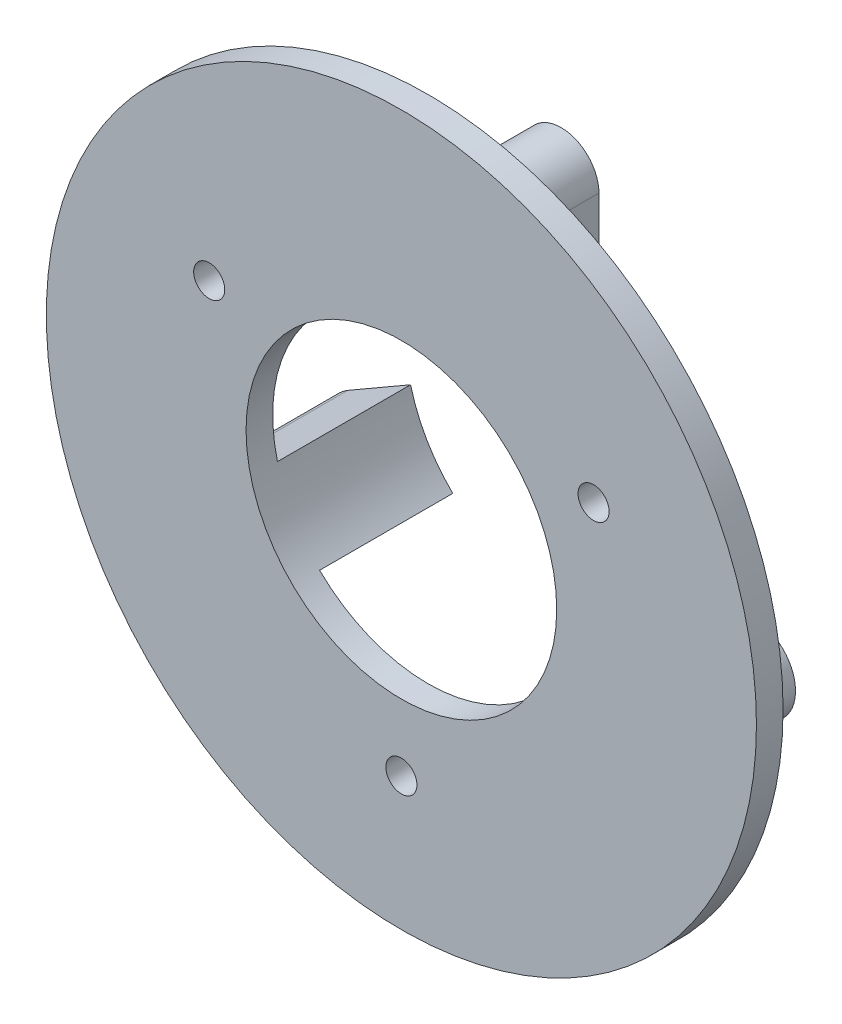
ISO-10303-21;
HEADER;
FILE_DESCRIPTION(('STEP AP214'),'2;1');
FILE_NAME('part.step','',(''),(''),'','','');
FILE_SCHEMA(('AUTOMOTIVE_DESIGN { 1 0 10303 214 1 1 1 1 }'));
ENDSEC;
DATA;
#1=APPLICATION_CONTEXT('core data for automotive mechanical design processes');
#2=APPLICATION_PROTOCOL_DEFINITION('international standard','automotive_design',2000,#1);
#3=PRODUCT_CONTEXT('',#1,'mechanical');
#4=PRODUCT('Part','Part','',(#3));
#5=PRODUCT_RELATED_PRODUCT_CATEGORY('part','',(#4));
#6=PRODUCT_DEFINITION_FORMATION('','',#4);
#7=PRODUCT_DEFINITION_CONTEXT('part definition',#1,'design');
#8=PRODUCT_DEFINITION('design','',#6,#7);
#9=PRODUCT_DEFINITION_SHAPE('','',#8);
#10=(LENGTH_UNIT() NAMED_UNIT(*) SI_UNIT(.MILLI.,.METRE.));
#11=(NAMED_UNIT(*) PLANE_ANGLE_UNIT() SI_UNIT($,.RADIAN.));
#12=(NAMED_UNIT(*) SI_UNIT($,.STERADIAN.) SOLID_ANGLE_UNIT());
#13=UNCERTAINTY_MEASURE_WITH_UNIT(LENGTH_MEASURE(1.E-05),#10,'distance_accuracy_value','');
#14=(GEOMETRIC_REPRESENTATION_CONTEXT(3) GLOBAL_UNCERTAINTY_ASSIGNED_CONTEXT((#13)) GLOBAL_UNIT_ASSIGNED_CONTEXT((#10,
#11,#12)) REPRESENTATION_CONTEXT('',''));
#15=CARTESIAN_POINT('',(0.,0.,0.));
#16=DIRECTION('',(0.,0.,1.));
#17=DIRECTION('',(1.,0.,0.));
#18=AXIS2_PLACEMENT_3D('',#15,#16,#17);
#19=CARTESIAN_POINT('',(0.,0.,1.2));
#20=DIRECTION('',(0.,0.,-1.));
#21=DIRECTION('',(-1.,0.,0.));
#22=AXIS2_PLACEMENT_3D('',#19,#20,#21);
#23=CYLINDRICAL_SURFACE('',#22,16.);
#24=CARTESIAN_POINT('',(0.,0.,1.2));
#25=DIRECTION('',(0.,0.,1.));
#26=DIRECTION('',(1.,0.,0.));
#27=AXIS2_PLACEMENT_3D('',#24,#25,#26);
#28=CIRCLE('',#27,16.);
#29=CARTESIAN_POINT('',(16.,0.,1.2));
#30=VERTEX_POINT('',#29);
#31=EDGE_CURVE('E238',#30,#30,#28,.T.);
#32=ORIENTED_EDGE('',*,*,#31,.F.);
#33=EDGE_LOOP('',(#32));
#34=FACE_BOUND('',#33,.T.);
#35=CARTESIAN_POINT('',(0.,0.,0.));
#36=DIRECTION('',(0.,0.,1.));
#37=DIRECTION('',(1.,0.,0.));
#38=AXIS2_PLACEMENT_3D('',#35,#36,#37);
#39=CIRCLE('',#38,16.);
#40=CARTESIAN_POINT('',(16.,0.,0.));
#41=VERTEX_POINT('',#40);
#42=EDGE_CURVE('E286',#41,#41,#39,.T.);
#43=ORIENTED_EDGE('',*,*,#42,.T.);
#44=EDGE_LOOP('',(#43));
#45=FACE_BOUND('',#44,.T.);
#46=ADVANCED_FACE('F39',(#34,#45),#23,.T.);
#47=CARTESIAN_POINT('',(0.,0.,1.2));
#48=DIRECTION('',(0.,0.,1.));
#49=DIRECTION('',(1.,0.,0.));
#50=AXIS2_PLACEMENT_3D('',#47,#48,#49);
#51=PLANE('',#50);
#52=CARTESIAN_POINT('',(8.66025403784438,5.00000000000001,1.2));
#53=DIRECTION('',(0.,0.,1.));
#54=DIRECTION('',(1.,0.,0.));
#55=AXIS2_PLACEMENT_3D('',#52,#53,#54);
#56=CIRCLE('',#55,0.7);
#57=CARTESIAN_POINT('',(9.36025403784438,5.00000000000001,1.2));
#58=VERTEX_POINT('',#57);
#59=EDGE_CURVE('E258',#58,#58,#56,.T.);
#60=ORIENTED_EDGE('',*,*,#59,.F.);
#61=EDGE_LOOP('',(#60));
#62=FACE_BOUND('',#61,.T.);
#63=CARTESIAN_POINT('',(0.,-10.,1.2));
#64=DIRECTION('',(0.,0.,1.));
#65=DIRECTION('',(1.,0.,0.));
#66=AXIS2_PLACEMENT_3D('',#63,#64,#65);
#67=CIRCLE('',#66,0.7);
#68=CARTESIAN_POINT('',(0.7,-10.,1.2));
#69=VERTEX_POINT('',#68);
#70=EDGE_CURVE('E266',#69,#69,#67,.T.);
#71=ORIENTED_EDGE('',*,*,#70,.F.);
#72=EDGE_LOOP('',(#71));
#73=FACE_BOUND('',#72,.T.);
#74=CARTESIAN_POINT('',(-8.66025403784438,5.00000000000001,1.2));
#75=DIRECTION('',(0.,0.,1.));
#76=DIRECTION('',(1.,0.,0.));
#77=AXIS2_PLACEMENT_3D('',#74,#75,#76);
#78=CIRCLE('',#77,0.7);
#79=CARTESIAN_POINT('',(-7.96025403784438,5.00000000000001,1.2));
#80=VERTEX_POINT('',#79);
#81=EDGE_CURVE('E252',#80,#80,#78,.T.);
#82=ORIENTED_EDGE('',*,*,#81,.F.);
#83=EDGE_LOOP('',(#82));
#84=FACE_BOUND('',#83,.T.);
#85=CARTESIAN_POINT('',(0.,0.,1.2));
#86=DIRECTION('',(0.,0.,1.));
#87=DIRECTION('',(1.,0.,0.));
#88=AXIS2_PLACEMENT_3D('',#85,#86,#87);
#89=CIRCLE('',#88,7.);
#90=CARTESIAN_POINT('',(7.,0.,1.2));
#91=VERTEX_POINT('',#90);
#92=EDGE_CURVE('E257',#91,#91,#89,.T.);
#93=ORIENTED_EDGE('',*,*,#92,.F.);
#94=EDGE_LOOP('',(#93));
#95=FACE_BOUND('',#94,.T.);
#96=ORIENTED_EDGE('',*,*,#31,.T.);
#97=EDGE_LOOP('',(#96));
#98=FACE_BOUND('',#97,.T.);
#99=ADVANCED_FACE('F349',(#62,#73,#84,#95,#98),#51,.T.);
#100=CARTESIAN_POINT('',(0.,0.,0.));
#101=DIRECTION('',(0.,0.,1.));
#102=DIRECTION('',(1.,0.,0.));
#103=AXIS2_PLACEMENT_3D('',#100,#101,#102);
#104=PLANE('',#103);
#105=DIRECTION('',(0.866025403784439,0.5,0.));
#106=VECTOR('',#105,1.);
#107=CARTESIAN_POINT('',(-5.53794600333848,-1.00340359286449,0.));
#108=LINE('',#107,#106);
#109=CARTESIAN_POINT('',(-9.61025403784438,-3.35455173280958,0.));
#110=VERTEX_POINT('',#109);
#111=CARTESIAN_POINT('',(-6.78459510163302,-1.72315678534985,0.));
#112=VERTEX_POINT('',#111);
#113=EDGE_CURVE('E62',#110,#112,#108,.T.);
#114=ORIENTED_EDGE('',*,*,#113,.F.);
#115=CARTESIAN_POINT('',(-8.66025403784438,-5.00000000000001,0.));
#116=DIRECTION('',(0.,0.,-1.));
#117=DIRECTION('',(-1.,0.,0.));
#118=AXIS2_PLACEMENT_3D('',#115,#116,#117);
#119=CIRCLE('',#118,1.9);
#120=CARTESIAN_POINT('',(-7.71025403784439,-6.64544826719042,0.));
#121=VERTEX_POINT('',#120);
#122=EDGE_CURVE('E163',#121,#110,#119,.T.);
#123=ORIENTED_EDGE('',*,*,#122,.F.);
#124=DIRECTION('',(-0.866025403784439,-0.5,0.));
#125=VECTOR('',#124,1.);
#126=CARTESIAN_POINT('',(-3.63794600333848,-4.29430012724536,0.));
#127=LINE('',#126,#125);
#128=CARTESIAN_POINT('',(-4.88459510163303,-5.01405331973072,0.));
#129=VERTEX_POINT('',#128);
#130=EDGE_CURVE('E170',#129,#121,#127,.T.);
#131=ORIENTED_EDGE('',*,*,#130,.F.);
#132=CARTESIAN_POINT('',(0.,0.,0.));
#133=DIRECTION('',(0.,0.,1.));
#134=DIRECTION('',(1.,0.,0.));
#135=AXIS2_PLACEMENT_3D('',#132,#133,#134);
#136=CIRCLE('',#135,7.);
#137=CARTESIAN_POINT('',(4.88459510163303,-5.01405331973072,0.));
#138=VERTEX_POINT('',#137);
#139=EDGE_CURVE('E133',#129,#138,#136,.T.);
#140=ORIENTED_EDGE('',*,*,#139,.T.);
#141=DIRECTION('',(-0.866025403784439,0.5,0.));
#142=VECTOR('',#141,1.);
#143=CARTESIAN_POINT('',(3.63794600333848,-4.29430012724536,0.));
#144=LINE('',#143,#142);
#145=CARTESIAN_POINT('',(7.71025403784439,-6.64544826719042,0.));
#146=VERTEX_POINT('',#145);
#147=EDGE_CURVE('E227',#146,#138,#144,.T.);
#148=ORIENTED_EDGE('',*,*,#147,.F.);
#149=CARTESIAN_POINT('',(8.66025403784438,-5.00000000000001,0.));
#150=DIRECTION('',(0.,0.,-1.));
#151=DIRECTION('',(-1.,0.,0.));
#152=AXIS2_PLACEMENT_3D('',#149,#150,#151);
#153=CIRCLE('',#152,1.9);
#154=CARTESIAN_POINT('',(9.61025403784438,-3.35455173280958,0.));
#155=VERTEX_POINT('',#154);
#156=EDGE_CURVE('E219',#155,#146,#153,.T.);
#157=ORIENTED_EDGE('',*,*,#156,.F.);
#158=DIRECTION('',(0.866025403784439,-0.5,0.));
#159=VECTOR('',#158,1.);
#160=CARTESIAN_POINT('',(5.53794600333848,-1.00340359286449,0.));
#161=LINE('',#160,#159);
#162=CARTESIAN_POINT('',(6.78459510163302,-1.72315678534985,0.));
#163=VERTEX_POINT('',#162);
#164=EDGE_CURVE('E47',#163,#155,#161,.T.);
#165=ORIENTED_EDGE('',*,*,#164,.F.);
#166=CARTESIAN_POINT('',(1.70389462333255,6.78945823409927,0.));
#167=VERTEX_POINT('',#166);
#168=EDGE_CURVE('E280',#163,#167,#136,.T.);
#169=ORIENTED_EDGE('',*,*,#168,.T.);
#170=DIRECTION('',(0.,-1.,0.));
#171=VECTOR('',#170,1.);
#172=CARTESIAN_POINT('',(1.70389462333255,5.39519544164019,0.));
#173=LINE('',#172,#171);
#174=CARTESIAN_POINT('',(1.70389462333255,10.,0.));
#175=VERTEX_POINT('',#174);
#176=EDGE_CURVE('E200',#175,#167,#173,.T.);
#177=ORIENTED_EDGE('',*,*,#176,.F.);
#178=CARTESIAN_POINT('',(0.,10.,0.));
#179=DIRECTION('',(0.,0.,-1.));
#180=DIRECTION('',(-1.,0.,0.));
#181=AXIS2_PLACEMENT_3D('',#178,#179,#180);
#182=CIRCLE('',#181,1.70389462333255);
#183=CARTESIAN_POINT('',(-1.70389462333255,10.,0.));
#184=VERTEX_POINT('',#183);
#185=EDGE_CURVE('E180',#184,#175,#182,.T.);
#186=ORIENTED_EDGE('',*,*,#185,.F.);
#187=DIRECTION('',(0.,1.,0.));
#188=VECTOR('',#187,1.);
#189=CARTESIAN_POINT('',(-1.70389462333255,10.,0.));
#190=LINE('',#189,#188);
#191=CARTESIAN_POINT('',(-1.70389462333255,6.78945823409927,0.));
#192=VERTEX_POINT('',#191);
#193=EDGE_CURVE('E189',#192,#184,#190,.T.);
#194=ORIENTED_EDGE('',*,*,#193,.F.);
#195=EDGE_CURVE('E279',#192,#112,#136,.T.);
#196=ORIENTED_EDGE('',*,*,#195,.T.);
#197=EDGE_LOOP('',(#114,#123,#131,#140,#148,#157,#165,#169,#177,#186,#194,#196));
#198=FACE_BOUND('',#197,.T.);
#199=CARTESIAN_POINT('',(8.66025403784438,5.00000000000001,0.));
#200=DIRECTION('',(0.,0.,1.));
#201=DIRECTION('',(1.,0.,0.));
#202=AXIS2_PLACEMENT_3D('',#199,#200,#201);
#203=CIRCLE('',#202,0.7);
#204=CARTESIAN_POINT('',(9.36025403784438,5.00000000000001,0.));
#205=VERTEX_POINT('',#204);
#206=EDGE_CURVE('E253',#205,#205,#203,.T.);
#207=ORIENTED_EDGE('',*,*,#206,.T.);
#208=EDGE_LOOP('',(#207));
#209=FACE_BOUND('',#208,.T.);
#210=CARTESIAN_POINT('',(0.,-10.,0.));
#211=DIRECTION('',(0.,0.,1.));
#212=DIRECTION('',(1.,0.,0.));
#213=AXIS2_PLACEMENT_3D('',#210,#211,#212);
#214=CIRCLE('',#213,0.7);
#215=CARTESIAN_POINT('',(0.7,-10.,0.));
#216=VERTEX_POINT('',#215);
#217=EDGE_CURVE('E262',#216,#216,#214,.T.);
#218=ORIENTED_EDGE('',*,*,#217,.T.);
#219=EDGE_LOOP('',(#218));
#220=FACE_BOUND('',#219,.T.);
#221=CARTESIAN_POINT('',(-8.66025403784438,5.00000000000001,0.));
#222=DIRECTION('',(0.,0.,1.));
#223=DIRECTION('',(1.,0.,0.));
#224=AXIS2_PLACEMENT_3D('',#221,#222,#223);
#225=CIRCLE('',#224,0.7);
#226=CARTESIAN_POINT('',(-7.96025403784438,5.00000000000001,0.));
#227=VERTEX_POINT('',#226);
#228=EDGE_CURVE('E270',#227,#227,#225,.T.);
#229=ORIENTED_EDGE('',*,*,#228,.T.);
#230=EDGE_LOOP('',(#229));
#231=FACE_BOUND('',#230,.T.);
#232=ORIENTED_EDGE('',*,*,#42,.F.);
#233=EDGE_LOOP('',(#232));
#234=FACE_BOUND('',#233,.T.);
#235=ADVANCED_FACE('F297',(#198,#209,#220,#231,#234),#104,.F.);
#236=CARTESIAN_POINT('',(0.,0.,0.));
#237=DIRECTION('',(0.,0.,1.));
#238=DIRECTION('',(1.,0.,0.));
#239=AXIS2_PLACEMENT_3D('',#236,#237,#238);
#240=CYLINDRICAL_SURFACE('',#239,7.);
#241=ORIENTED_EDGE('',*,*,#168,.F.);
#242=DIRECTION('',(0.,0.,1.));
#243=VECTOR('',#242,1.);
#244=CARTESIAN_POINT('',(6.78459510163302,-1.72315678534985,-9.8));
#245=LINE('',#244,#243);
#246=CARTESIAN_POINT('',(6.78459510163302,-1.72315678534985,-6.));
#247=VERTEX_POINT('',#246);
#248=EDGE_CURVE('E316',#247,#163,#245,.T.);
#249=ORIENTED_EDGE('',*,*,#248,.F.);
#250=CARTESIAN_POINT('',(0.,0.,-6.));
#251=DIRECTION('',(0.,0.,-1.));
#252=DIRECTION('',(-1.,0.,0.));
#253=AXIS2_PLACEMENT_3D('',#250,#251,#252);
#254=CIRCLE('',#253,7.);
#255=CARTESIAN_POINT('',(4.88459510163303,-5.01405331973072,-6.));
#256=VERTEX_POINT('',#255);
#257=EDGE_CURVE('E54',#247,#256,#254,.T.);
#258=ORIENTED_EDGE('',*,*,#257,.T.);
#259=DIRECTION('',(0.,0.,1.));
#260=VECTOR('',#259,1.);
#261=CARTESIAN_POINT('',(4.88459510163303,-5.01405331973072,-9.8));
#262=LINE('',#261,#260);
#263=EDGE_CURVE('E307',#138,#256,#262,.F.);
#264=ORIENTED_EDGE('',*,*,#263,.F.);
#265=ORIENTED_EDGE('',*,*,#139,.F.);
#266=DIRECTION('',(0.,0.,1.));
#267=VECTOR('',#266,1.);
#268=CARTESIAN_POINT('',(-4.88459510163303,-5.01405331973072,-9.8));
#269=LINE('',#268,#267);
#270=CARTESIAN_POINT('',(-4.88459510163303,-5.01405331973072,-6.));
#271=VERTEX_POINT('',#270);
#272=EDGE_CURVE('E11',#271,#129,#269,.T.);
#273=ORIENTED_EDGE('',*,*,#272,.F.);
#274=CARTESIAN_POINT('',(0.,0.,-6.));
#275=DIRECTION('',(0.,0.,-1.));
#276=DIRECTION('',(-1.,0.,0.));
#277=AXIS2_PLACEMENT_3D('',#274,#275,#276);
#278=CIRCLE('',#277,7.);
#279=CARTESIAN_POINT('',(-6.78459510163302,-1.72315678534985,-6.));
#280=VERTEX_POINT('',#279);
#281=EDGE_CURVE('E130',#271,#280,#278,.T.);
#282=ORIENTED_EDGE('',*,*,#281,.T.);
#283=DIRECTION('',(0.,0.,1.));
#284=VECTOR('',#283,1.);
#285=CARTESIAN_POINT('',(-6.78459510163302,-1.72315678534985,-9.8));
#286=LINE('',#285,#284);
#287=EDGE_CURVE('E147',#112,#280,#286,.F.);
#288=ORIENTED_EDGE('',*,*,#287,.F.);
#289=ORIENTED_EDGE('',*,*,#195,.F.);
#290=DIRECTION('',(0.,0.,1.));
#291=VECTOR('',#290,1.);
#292=CARTESIAN_POINT('',(-1.70389462333255,6.78945823409927,-9.8));
#293=LINE('',#292,#291);
#294=CARTESIAN_POINT('',(-1.70389462333255,6.78945823409927,-6.));
#295=VERTEX_POINT('',#294);
#296=EDGE_CURVE('E579',#295,#192,#293,.T.);
#297=ORIENTED_EDGE('',*,*,#296,.F.);
#298=CARTESIAN_POINT('',(0.,0.,-6.));
#299=DIRECTION('',(0.,0.,-1.));
#300=DIRECTION('',(-1.,0.,0.));
#301=AXIS2_PLACEMENT_3D('',#298,#299,#300);
#302=CIRCLE('',#301,7.);
#303=CARTESIAN_POINT('',(1.70389462333255,6.78945823409927,-6.));
#304=VERTEX_POINT('',#303);
#305=EDGE_CURVE('E573',#295,#304,#302,.T.);
#306=ORIENTED_EDGE('',*,*,#305,.T.);
#307=DIRECTION('',(0.,0.,1.));
#308=VECTOR('',#307,1.);
#309=CARTESIAN_POINT('',(1.70389462333255,6.78945823409927,-9.8));
#310=LINE('',#309,#308);
#311=EDGE_CURVE('E578',#167,#304,#310,.F.);
#312=ORIENTED_EDGE('',*,*,#311,.F.);
#313=EDGE_LOOP('',(#241,#249,#258,#264,#265,#273,#282,#288,#289,#297,#306,#312));
#314=FACE_BOUND('',#313,.T.);
#315=ORIENTED_EDGE('',*,*,#92,.T.);
#316=EDGE_LOOP('',(#315));
#317=FACE_BOUND('',#316,.T.);
#318=ADVANCED_FACE('F128',(#314,#317),#240,.F.);
#319=CARTESIAN_POINT('',(-8.66025403784438,5.00000000000001,0.));
#320=DIRECTION('',(0.,0.,1.));
#321=DIRECTION('',(1.,0.,0.));
#322=AXIS2_PLACEMENT_3D('',#319,#320,#321);
#323=CYLINDRICAL_SURFACE('',#322,0.7);
#324=ORIENTED_EDGE('',*,*,#228,.F.);
#325=EDGE_LOOP('',(#324));
#326=FACE_BOUND('',#325,.T.);
#327=ORIENTED_EDGE('',*,*,#81,.T.);
#328=EDGE_LOOP('',(#327));
#329=FACE_BOUND('',#328,.T.);
#330=ADVANCED_FACE('F366',(#326,#329),#323,.F.);
#331=CARTESIAN_POINT('',(0.,-10.,0.));
#332=DIRECTION('',(0.,0.,1.));
#333=DIRECTION('',(1.,0.,0.));
#334=AXIS2_PLACEMENT_3D('',#331,#332,#333);
#335=CYLINDRICAL_SURFACE('',#334,0.7);
#336=ORIENTED_EDGE('',*,*,#217,.F.);
#337=EDGE_LOOP('',(#336));
#338=FACE_BOUND('',#337,.T.);
#339=ORIENTED_EDGE('',*,*,#70,.T.);
#340=EDGE_LOOP('',(#339));
#341=FACE_BOUND('',#340,.T.);
#342=ADVANCED_FACE('F369',(#338,#341),#335,.F.);
#343=CARTESIAN_POINT('',(8.66025403784438,5.00000000000001,0.));
#344=DIRECTION('',(0.,0.,1.));
#345=DIRECTION('',(1.,0.,0.));
#346=AXIS2_PLACEMENT_3D('',#343,#344,#345);
#347=CYLINDRICAL_SURFACE('',#346,0.7);
#348=ORIENTED_EDGE('',*,*,#206,.F.);
#349=EDGE_LOOP('',(#348));
#350=FACE_BOUND('',#349,.T.);
#351=ORIENTED_EDGE('',*,*,#59,.T.);
#352=EDGE_LOOP('',(#351));
#353=FACE_BOUND('',#352,.T.);
#354=ADVANCED_FACE('F373',(#350,#353),#347,.F.);
#355=CARTESIAN_POINT('',(8.66025403784438,-5.00000000000001,-6.));
#356=DIRECTION('',(0.,0.,-1.));
#357=DIRECTION('',(-1.,0.,0.));
#358=AXIS2_PLACEMENT_3D('',#355,#356,#357);
#359=PLANE('',#358);
#360=ORIENTED_EDGE('',*,*,#257,.F.);
#361=DIRECTION('',(0.866025403784439,-0.5,0.));
#362=VECTOR('',#361,1.);
#363=CARTESIAN_POINT('',(5.53794600333848,-1.00340359286449,-6.));
#364=LINE('',#363,#362);
#365=CARTESIAN_POINT('',(9.61025403784438,-3.35455173280958,-6.));
#366=VERTEX_POINT('',#365);
#367=EDGE_CURVE('E223',#247,#366,#364,.T.);
#368=ORIENTED_EDGE('',*,*,#367,.T.);
#369=CARTESIAN_POINT('',(8.66025403784438,-5.00000000000001,-6.));
#370=DIRECTION('',(0.,0.,-1.));
#371=DIRECTION('',(-1.,0.,0.));
#372=AXIS2_PLACEMENT_3D('',#369,#370,#371);
#373=CIRCLE('',#372,1.9);
#374=CARTESIAN_POINT('',(7.71025403784439,-6.64544826719042,-6.));
#375=VERTEX_POINT('',#374);
#376=EDGE_CURVE('E226',#366,#375,#373,.T.);
#377=ORIENTED_EDGE('',*,*,#376,.T.);
#378=DIRECTION('',(-0.866025403784439,0.5,0.));
#379=VECTOR('',#378,1.);
#380=CARTESIAN_POINT('',(3.63794600333848,-4.29430012724536,-6.));
#381=LINE('',#380,#379);
#382=EDGE_CURVE('E230',#375,#256,#381,.T.);
#383=ORIENTED_EDGE('',*,*,#382,.T.);
#384=EDGE_LOOP('',(#360,#368,#377,#383));
#385=FACE_BOUND('',#384,.T.);
#386=CARTESIAN_POINT('',(8.66025403784438,-5.00000000000001,-6.));
#387=DIRECTION('',(0.,0.,-1.));
#388=DIRECTION('',(-1.,0.,0.));
#389=AXIS2_PLACEMENT_3D('',#386,#387,#388);
#390=CIRCLE('',#389,0.899999999999999);
#391=CARTESIAN_POINT('',(7.76025403784438,-5.00000000000001,-6.));
#392=VERTEX_POINT('',#391);
#393=EDGE_CURVE('E215',#392,#392,#390,.T.);
#394=ORIENTED_EDGE('',*,*,#393,.F.);
#395=EDGE_LOOP('',(#394));
#396=FACE_BOUND('',#395,.T.);
#397=ADVANCED_FACE('F377',(#385,#396),#359,.T.);
#398=CARTESIAN_POINT('',(5.53794600333848,-1.00340359286449,-6.));
#399=DIRECTION('',(-0.5,-0.866025403784439,0.));
#400=DIRECTION('',(0.866025403784439,-0.5,0.));
#401=AXIS2_PLACEMENT_3D('',#398,#399,#400);
#402=PLANE('',#401);
#403=ORIENTED_EDGE('',*,*,#367,.F.);
#404=ORIENTED_EDGE('',*,*,#248,.T.);
#405=ORIENTED_EDGE('',*,*,#164,.T.);
#406=DIRECTION('',(0.,0.,1.));
#407=VECTOR('',#406,1.);
#408=CARTESIAN_POINT('',(9.61025403784438,-3.35455173280958,-6.));
#409=LINE('',#408,#407);
#410=EDGE_CURVE('E248',#366,#155,#409,.T.);
#411=ORIENTED_EDGE('',*,*,#410,.F.);
#412=EDGE_LOOP('',(#403,#404,#405,#411));
#413=FACE_BOUND('',#412,.T.);
#414=ADVANCED_FACE('F315',(#413),#402,.F.);
#415=CARTESIAN_POINT('',(8.66025403784438,-5.00000000000001,-6.));
#416=DIRECTION('',(0.,0.,1.));
#417=DIRECTION('',(1.,0.,0.));
#418=AXIS2_PLACEMENT_3D('',#415,#416,#417);
#419=CYLINDRICAL_SURFACE('',#418,1.9);
#420=ORIENTED_EDGE('',*,*,#156,.T.);
#421=DIRECTION('',(0.,0.,1.));
#422=VECTOR('',#421,1.);
#423=CARTESIAN_POINT('',(7.71025403784439,-6.64544826719042,-6.));
#424=LINE('',#423,#422);
#425=EDGE_CURVE('E234',#375,#146,#424,.T.);
#426=ORIENTED_EDGE('',*,*,#425,.F.);
#427=ORIENTED_EDGE('',*,*,#376,.F.);
#428=ORIENTED_EDGE('',*,*,#410,.T.);
#429=EDGE_LOOP('',(#420,#426,#427,#428));
#430=FACE_BOUND('',#429,.T.);
#431=ADVANCED_FACE('F311',(#430),#419,.T.);
#432=CARTESIAN_POINT('',(3.63794600333848,-4.29430012724536,-6.));
#433=DIRECTION('',(0.5,0.866025403784439,0.));
#434=DIRECTION('',(-0.866025403784439,0.5,0.));
#435=AXIS2_PLACEMENT_3D('',#432,#433,#434);
#436=PLANE('',#435);
#437=ORIENTED_EDGE('',*,*,#147,.T.);
#438=ORIENTED_EDGE('',*,*,#263,.T.);
#439=ORIENTED_EDGE('',*,*,#382,.F.);
#440=ORIENTED_EDGE('',*,*,#425,.T.);
#441=EDGE_LOOP('',(#437,#438,#439,#440));
#442=FACE_BOUND('',#441,.T.);
#443=ADVANCED_FACE('F305',(#442),#436,.F.);
#444=CARTESIAN_POINT('',(8.66025403784438,-5.00000000000001,-6.));
#445=DIRECTION('',(0.,0.,1.));
#446=DIRECTION('',(1.,0.,0.));
#447=AXIS2_PLACEMENT_3D('',#444,#445,#446);
#448=CYLINDRICAL_SURFACE('',#447,0.899999999999999);
#449=ORIENTED_EDGE('',*,*,#393,.T.);
#450=EDGE_LOOP('',(#449));
#451=FACE_BOUND('',#450,.T.);
#452=CARTESIAN_POINT('',(8.66025403784438,-5.00000000000001,0.));
#453=DIRECTION('',(0.,0.,-1.));
#454=DIRECTION('',(-1.,0.,0.));
#455=AXIS2_PLACEMENT_3D('',#452,#453,#454);
#456=CIRCLE('',#455,0.899999999999999);
#457=CARTESIAN_POINT('',(7.76025403784438,-5.00000000000001,0.));
#458=VERTEX_POINT('',#457);
#459=EDGE_CURVE('E214',#458,#458,#456,.T.);
#460=ORIENTED_EDGE('',*,*,#459,.F.);
#461=EDGE_LOOP('',(#460));
#462=FACE_BOUND('',#461,.T.);
#463=ADVANCED_FACE('F385',(#451,#462),#448,.F.);
#464=ORIENTED_EDGE('',*,*,#459,.T.);
#465=EDGE_LOOP('',(#464));
#466=FACE_BOUND('',#465,.T.);
#467=ADVANCED_FACE('F344',(#466),#104,.F.);
#468=CARTESIAN_POINT('',(0.,10.,-6.));
#469=DIRECTION('',(0.,0.,-1.));
#470=DIRECTION('',(-1.,0.,0.));
#471=AXIS2_PLACEMENT_3D('',#468,#469,#470);
#472=PLANE('',#471);
#473=ORIENTED_EDGE('',*,*,#305,.F.);
#474=DIRECTION('',(0.,1.,0.));
#475=VECTOR('',#474,1.);
#476=CARTESIAN_POINT('',(-1.70389462333255,10.,-6.));
#477=LINE('',#476,#475);
#478=CARTESIAN_POINT('',(-1.70389462333255,10.,-6.));
#479=VERTEX_POINT('',#478);
#480=EDGE_CURVE('E193',#295,#479,#477,.T.);
#481=ORIENTED_EDGE('',*,*,#480,.T.);
#482=CARTESIAN_POINT('',(0.,10.,-6.));
#483=DIRECTION('',(0.,0.,-1.));
#484=DIRECTION('',(-1.,0.,0.));
#485=AXIS2_PLACEMENT_3D('',#482,#483,#484);
#486=CIRCLE('',#485,1.70389462333255);
#487=CARTESIAN_POINT('',(1.70389462333255,10.,-6.));
#488=VERTEX_POINT('',#487);
#489=EDGE_CURVE('E184',#479,#488,#486,.T.);
#490=ORIENTED_EDGE('',*,*,#489,.T.);
#491=DIRECTION('',(0.,-1.,0.));
#492=VECTOR('',#491,1.);
#493=CARTESIAN_POINT('',(1.70389462333255,5.39519544164019,-6.));
#494=LINE('',#493,#492);
#495=EDGE_CURVE('E188',#488,#304,#494,.T.);
#496=ORIENTED_EDGE('',*,*,#495,.T.);
#497=EDGE_LOOP('',(#473,#481,#490,#496));
#498=FACE_BOUND('',#497,.T.);
#499=CARTESIAN_POINT('',(0.,10.,-6.));
#500=DIRECTION('',(0.,0.,-1.));
#501=DIRECTION('',(-1.,0.,0.));
#502=AXIS2_PLACEMENT_3D('',#499,#500,#501);
#503=CIRCLE('',#502,0.9);
#504=CARTESIAN_POINT('',(-0.9,10.,-6.));
#505=VERTEX_POINT('',#504);
#506=EDGE_CURVE('E176',#505,#505,#503,.T.);
#507=ORIENTED_EDGE('',*,*,#506,.F.);
#508=EDGE_LOOP('',(#507));
#509=FACE_BOUND('',#508,.T.);
#510=ADVANCED_FACE('F396',(#498,#509),#472,.T.);
#511=CARTESIAN_POINT('',(0.,10.,-6.));
#512=DIRECTION('',(0.,0.,1.));
#513=DIRECTION('',(1.,0.,0.));
#514=AXIS2_PLACEMENT_3D('',#511,#512,#513);
#515=CYLINDRICAL_SURFACE('',#514,1.70389462333255);
#516=ORIENTED_EDGE('',*,*,#185,.T.);
#517=DIRECTION('',(0.,0.,1.));
#518=VECTOR('',#517,1.);
#519=CARTESIAN_POINT('',(1.70389462333255,10.,-6.));
#520=LINE('',#519,#518);
#521=EDGE_CURVE('E210',#488,#175,#520,.T.);
#522=ORIENTED_EDGE('',*,*,#521,.F.);
#523=ORIENTED_EDGE('',*,*,#489,.F.);
#524=DIRECTION('',(0.,0.,1.));
#525=VECTOR('',#524,1.);
#526=CARTESIAN_POINT('',(-1.70389462333255,10.,-6.));
#527=LINE('',#526,#525);
#528=EDGE_CURVE('E196',#479,#184,#527,.T.);
#529=ORIENTED_EDGE('',*,*,#528,.T.);
#530=EDGE_LOOP('',(#516,#522,#523,#529));
#531=FACE_BOUND('',#530,.T.);
#532=ADVANCED_FACE('F392',(#531),#515,.T.);
#533=CARTESIAN_POINT('',(1.70389462333255,5.39519544164019,-6.));
#534=DIRECTION('',(-1.,0.,0.));
#535=DIRECTION('',(0.,0.,1.));
#536=AXIS2_PLACEMENT_3D('',#533,#534,#535);
#537=PLANE('',#536);
#538=ORIENTED_EDGE('',*,*,#176,.T.);
#539=ORIENTED_EDGE('',*,*,#311,.T.);
#540=ORIENTED_EDGE('',*,*,#495,.F.);
#541=ORIENTED_EDGE('',*,*,#521,.T.);
#542=EDGE_LOOP('',(#538,#539,#540,#541));
#543=FACE_BOUND('',#542,.T.);
#544=ADVANCED_FACE('F395',(#543),#537,.F.);
#545=CARTESIAN_POINT('',(-1.70389462333255,10.,-6.));
#546=DIRECTION('',(1.,0.,0.));
#547=DIRECTION('',(0.,0.,-1.));
#548=AXIS2_PLACEMENT_3D('',#545,#546,#547);
#549=PLANE('',#548);
#550=ORIENTED_EDGE('',*,*,#480,.F.);
#551=ORIENTED_EDGE('',*,*,#296,.T.);
#552=ORIENTED_EDGE('',*,*,#193,.T.);
#553=ORIENTED_EDGE('',*,*,#528,.F.);
#554=EDGE_LOOP('',(#550,#551,#552,#553));
#555=FACE_BOUND('',#554,.T.);
#556=ADVANCED_FACE('F400',(#555),#549,.F.);
#557=CARTESIAN_POINT('',(0.,10.,-6.));
#558=DIRECTION('',(0.,0.,1.));
#559=DIRECTION('',(1.,0.,0.));
#560=AXIS2_PLACEMENT_3D('',#557,#558,#559);
#561=CYLINDRICAL_SURFACE('',#560,0.9);
#562=ORIENTED_EDGE('',*,*,#506,.T.);
#563=EDGE_LOOP('',(#562));
#564=FACE_BOUND('',#563,.T.);
#565=CARTESIAN_POINT('',(0.,10.,0.));
#566=DIRECTION('',(0.,0.,-1.));
#567=DIRECTION('',(-1.,0.,0.));
#568=AXIS2_PLACEMENT_3D('',#565,#566,#567);
#569=CIRCLE('',#568,0.9);
#570=CARTESIAN_POINT('',(-0.9,10.,0.));
#571=VERTEX_POINT('',#570);
#572=EDGE_CURVE('E175',#571,#571,#569,.T.);
#573=ORIENTED_EDGE('',*,*,#572,.F.);
#574=EDGE_LOOP('',(#573));
#575=FACE_BOUND('',#574,.T.);
#576=ADVANCED_FACE('F342',(#564,#575),#561,.F.);
#577=ORIENTED_EDGE('',*,*,#572,.T.);
#578=EDGE_LOOP('',(#577));
#579=FACE_BOUND('',#578,.T.);
#580=ADVANCED_FACE('F335',(#579),#104,.F.);
#581=CARTESIAN_POINT('',(-8.66025403784438,-5.00000000000001,-6.));
#582=DIRECTION('',(0.,0.,-1.));
#583=DIRECTION('',(-1.,0.,0.));
#584=AXIS2_PLACEMENT_3D('',#581,#582,#583);
#585=PLANE('',#584);
#586=ORIENTED_EDGE('',*,*,#281,.F.);
#587=DIRECTION('',(-0.866025403784439,-0.5,0.));
#588=VECTOR('',#587,1.);
#589=CARTESIAN_POINT('',(-3.63794600333848,-4.29430012724536,-6.));
#590=LINE('',#589,#588);
#591=CARTESIAN_POINT('',(-7.71025403784439,-6.64544826719042,-6.));
#592=VERTEX_POINT('',#591);
#593=EDGE_CURVE('E143',#271,#592,#590,.T.);
#594=ORIENTED_EDGE('',*,*,#593,.T.);
#595=CARTESIAN_POINT('',(-8.66025403784438,-5.00000000000001,-6.));
#596=DIRECTION('',(0.,0.,-1.));
#597=DIRECTION('',(-1.,0.,0.));
#598=AXIS2_PLACEMENT_3D('',#595,#596,#597);
#599=CIRCLE('',#598,1.9);
#600=CARTESIAN_POINT('',(-9.6102540378444,-3.35455173280955,-6.));
#601=VERTEX_POINT('',#600);
#602=EDGE_CURVE('E159',#592,#601,#599,.T.);
#603=ORIENTED_EDGE('',*,*,#602,.T.);
#604=DIRECTION('',(0.866025403784439,0.5,0.));
#605=VECTOR('',#604,1.);
#606=CARTESIAN_POINT('',(-5.53794600333848,-1.00340359286449,-6.));
#607=LINE('',#606,#605);
#608=EDGE_CURVE('E145',#601,#280,#607,.T.);
#609=ORIENTED_EDGE('',*,*,#608,.T.);
#610=EDGE_LOOP('',(#586,#594,#603,#609));
#611=FACE_BOUND('',#610,.T.);
#612=CARTESIAN_POINT('',(-8.66025403784438,-5.00000000000001,-6.));
#613=DIRECTION('',(0.,0.,-1.));
#614=DIRECTION('',(-1.,0.,0.));
#615=AXIS2_PLACEMENT_3D('',#612,#613,#614);
#616=CIRCLE('',#615,0.9);
#617=CARTESIAN_POINT('',(-9.56025403784438,-5.00000000000001,-6.));
#618=VERTEX_POINT('',#617);
#619=EDGE_CURVE('E167',#618,#618,#616,.T.);
#620=ORIENTED_EDGE('',*,*,#619,.F.);
#621=EDGE_LOOP('',(#620));
#622=FACE_BOUND('',#621,.T.);
#623=ADVANCED_FACE('F140',(#611,#622),#585,.T.);
#624=CARTESIAN_POINT('',(-8.66025403784438,-5.00000000000001,-6.));
#625=DIRECTION('',(0.,0.,1.));
#626=DIRECTION('',(1.,0.,0.));
#627=AXIS2_PLACEMENT_3D('',#624,#625,#626);
#628=CYLINDRICAL_SURFACE('',#627,1.9);
#629=ORIENTED_EDGE('',*,*,#122,.T.);
#630=DIRECTION('',(0.,0.,1.));
#631=VECTOR('',#630,1.);
#632=CARTESIAN_POINT('',(-9.6102540378444,-3.35455173280955,-6.));
#633=LINE('',#632,#631);
#634=EDGE_CURVE('E157',#601,#110,#633,.T.);
#635=ORIENTED_EDGE('',*,*,#634,.F.);
#636=ORIENTED_EDGE('',*,*,#602,.F.);
#637=DIRECTION('',(0.,0.,1.));
#638=VECTOR('',#637,1.);
#639=CARTESIAN_POINT('',(-7.71025403784439,-6.64544826719042,-6.));
#640=LINE('',#639,#638);
#641=EDGE_CURVE('E151',#592,#121,#640,.T.);
#642=ORIENTED_EDGE('',*,*,#641,.T.);
#643=EDGE_LOOP('',(#629,#635,#636,#642));
#644=FACE_BOUND('',#643,.T.);
#645=ADVANCED_FACE('F303',(#644),#628,.T.);
#646=CARTESIAN_POINT('',(-5.53794600333848,-1.00340359286449,-6.));
#647=DIRECTION('',(0.5,-0.866025403784439,0.));
#648=DIRECTION('',(0.866025403784439,0.5,0.));
#649=AXIS2_PLACEMENT_3D('',#646,#647,#648);
#650=PLANE('',#649);
#651=ORIENTED_EDGE('',*,*,#113,.T.);
#652=ORIENTED_EDGE('',*,*,#287,.T.);
#653=ORIENTED_EDGE('',*,*,#608,.F.);
#654=ORIENTED_EDGE('',*,*,#634,.T.);
#655=EDGE_LOOP('',(#651,#652,#653,#654));
#656=FACE_BOUND('',#655,.T.);
#657=ADVANCED_FACE('F300',(#656),#650,.F.);
#658=CARTESIAN_POINT('',(-3.63794600333848,-4.29430012724536,-6.));
#659=DIRECTION('',(-0.5,0.866025403784439,0.));
#660=DIRECTION('',(-0.866025403784439,-0.5,0.));
#661=AXIS2_PLACEMENT_3D('',#658,#659,#660);
#662=PLANE('',#661);
#663=ORIENTED_EDGE('',*,*,#593,.F.);
#664=ORIENTED_EDGE('',*,*,#272,.T.);
#665=ORIENTED_EDGE('',*,*,#130,.T.);
#666=ORIENTED_EDGE('',*,*,#641,.F.);
#667=EDGE_LOOP('',(#663,#664,#665,#666));
#668=FACE_BOUND('',#667,.T.);
#669=ADVANCED_FACE('F149',(#668),#662,.F.);
#670=CARTESIAN_POINT('',(-8.66025403784438,-5.00000000000001,-6.));
#671=DIRECTION('',(0.,0.,1.));
#672=DIRECTION('',(1.,0.,0.));
#673=AXIS2_PLACEMENT_3D('',#670,#671,#672);
#674=CYLINDRICAL_SURFACE('',#673,0.9);
#675=ORIENTED_EDGE('',*,*,#619,.T.);
#676=EDGE_LOOP('',(#675));
#677=FACE_BOUND('',#676,.T.);
#678=CARTESIAN_POINT('',(-8.66025403784438,-5.00000000000001,0.));
#679=DIRECTION('',(0.,0.,-1.));
#680=DIRECTION('',(-1.,0.,0.));
#681=AXIS2_PLACEMENT_3D('',#678,#679,#680);
#682=CIRCLE('',#681,0.9);
#683=CARTESIAN_POINT('',(-9.56025403784438,-5.00000000000001,0.));
#684=VERTEX_POINT('',#683);
#685=EDGE_CURVE('E318',#684,#684,#682,.T.);
#686=ORIENTED_EDGE('',*,*,#685,.F.);
#687=EDGE_LOOP('',(#686));
#688=FACE_BOUND('',#687,.T.);
#689=ADVANCED_FACE('F332',(#677,#688),#674,.F.);
#690=ORIENTED_EDGE('',*,*,#685,.T.);
#691=EDGE_LOOP('',(#690));
#692=FACE_BOUND('',#691,.T.);
#693=ADVANCED_FACE('F345',(#692),#104,.F.);
#694=CLOSED_SHELL('',(#46,#99,#235,#318,#330,#342,#354,#397,#414,#431,#443,#463,#467,#510,#532,
#544,#556,#576,#580,#623,#645,#657,#669,#689,#693));
#695=MANIFOLD_SOLID_BREP('B2',#694);
#696=ADVANCED_BREP_SHAPE_REPRESENTATION('',(#18,#695),#14);
#697=SHAPE_DEFINITION_REPRESENTATION(#9,#696);
ENDSEC;
END-ISO-10303-21;
